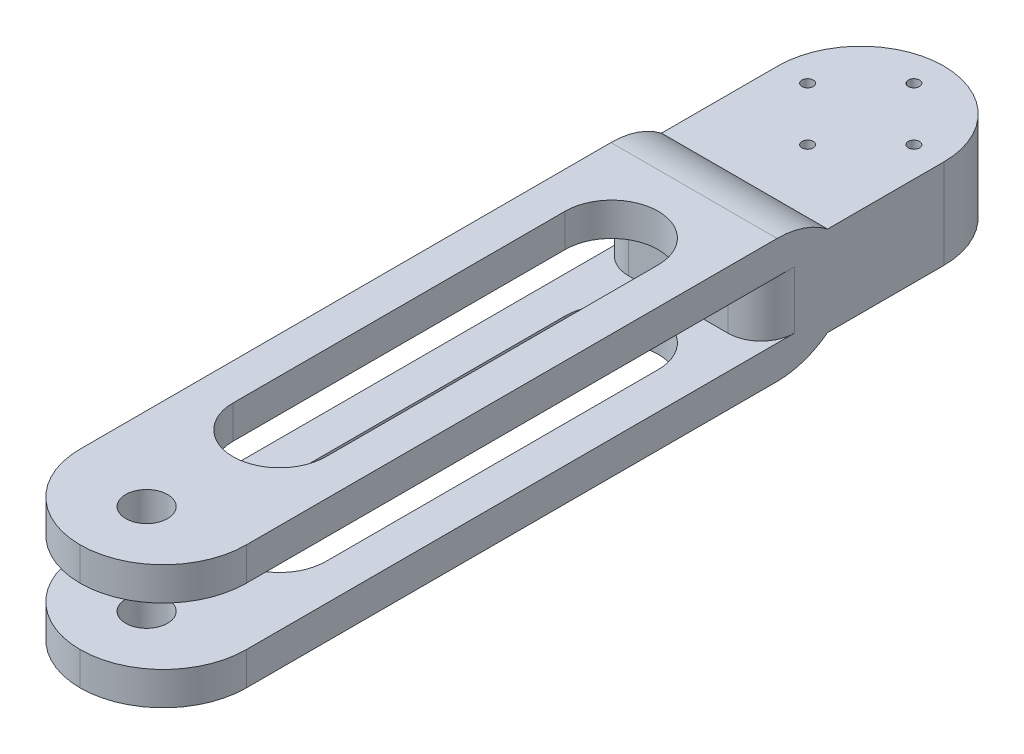
ISO-10303-21;
HEADER;
FILE_DESCRIPTION(('STEP AP214'),'2;1');
FILE_NAME('part.step','',(''),(''),'','','');
FILE_SCHEMA(('AUTOMOTIVE_DESIGN { 1 0 10303 214 1 1 1 1 }'));
ENDSEC;
DATA;
#1=APPLICATION_CONTEXT('core data for automotive mechanical design processes');
#2=APPLICATION_PROTOCOL_DEFINITION('international standard','automotive_design',2000,#1);
#3=PRODUCT_CONTEXT('',#1,'mechanical');
#4=PRODUCT('Part','Part','',(#3));
#5=PRODUCT_RELATED_PRODUCT_CATEGORY('part','',(#4));
#6=PRODUCT_DEFINITION_FORMATION('','',#4);
#7=PRODUCT_DEFINITION_CONTEXT('part definition',#1,'design');
#8=PRODUCT_DEFINITION('design','',#6,#7);
#9=PRODUCT_DEFINITION_SHAPE('','',#8);
#10=(LENGTH_UNIT() NAMED_UNIT(*) SI_UNIT(.MILLI.,.METRE.));
#11=(NAMED_UNIT(*) PLANE_ANGLE_UNIT() SI_UNIT($,.RADIAN.));
#12=(NAMED_UNIT(*) SI_UNIT($,.STERADIAN.) SOLID_ANGLE_UNIT());
#13=UNCERTAINTY_MEASURE_WITH_UNIT(LENGTH_MEASURE(1.E-05),#10,'distance_accuracy_value','');
#14=(GEOMETRIC_REPRESENTATION_CONTEXT(3) GLOBAL_UNCERTAINTY_ASSIGNED_CONTEXT((#13)) GLOBAL_UNIT_ASSIGNED_CONTEXT((#10,
#11,#12)) REPRESENTATION_CONTEXT('',''));
#15=CARTESIAN_POINT('',(0.,0.,0.));
#16=DIRECTION('',(0.,0.,1.));
#17=DIRECTION('',(1.,0.,0.));
#18=AXIS2_PLACEMENT_3D('',#15,#16,#17);
#19=CARTESIAN_POINT('',(12.5,4.325,10.));
#20=DIRECTION('',(0.,1.,0.));
#21=DIRECTION('',(0.,0.,1.));
#22=AXIS2_PLACEMENT_3D('',#19,#20,#21);
#23=PLANE('',#22);
#24=DIRECTION('',(0.,0.,-1.));
#25=VECTOR('',#24,1.);
#26=CARTESIAN_POINT('',(7.,4.325,10.));
#27=LINE('',#26,#25);
#28=CARTESIAN_POINT('',(7.,4.325,-20.));
#29=VERTEX_POINT('',#28);
#30=CARTESIAN_POINT('',(7.00000000000001,4.325,-70.));
#31=VERTEX_POINT('',#30);
#32=EDGE_CURVE('E294',#29,#31,#27,.T.);
#33=ORIENTED_EDGE('',*,*,#32,.T.);
#34=CARTESIAN_POINT('',(0.,4.325,-70.));
#35=DIRECTION('',(0.,1.,0.));
#36=DIRECTION('',(0.,0.,1.));
#37=AXIS2_PLACEMENT_3D('',#34,#35,#36);
#38=CIRCLE('',#37,7.00000000000001);
#39=CARTESIAN_POINT('',(-7.00000000000001,4.325,-70.));
#40=VERTEX_POINT('',#39);
#41=EDGE_CURVE('E300',#31,#40,#38,.T.);
#42=ORIENTED_EDGE('',*,*,#41,.T.);
#43=DIRECTION('',(0.,0.,1.));
#44=VECTOR('',#43,1.);
#45=CARTESIAN_POINT('',(-7.,4.325,10.));
#46=LINE('',#45,#44);
#47=CARTESIAN_POINT('',(-7.00000000000001,4.325,-20.));
#48=VERTEX_POINT('',#47);
#49=EDGE_CURVE('E278',#40,#48,#46,.T.);
#50=ORIENTED_EDGE('',*,*,#49,.T.);
#51=CARTESIAN_POINT('',(0.,4.325,-20.));
#52=DIRECTION('',(0.,1.,0.));
#53=DIRECTION('',(0.,0.,1.));
#54=AXIS2_PLACEMENT_3D('',#51,#52,#53);
#55=CIRCLE('',#54,7.);
#56=EDGE_CURVE('E286',#48,#29,#55,.T.);
#57=ORIENTED_EDGE('',*,*,#56,.T.);
#58=EDGE_LOOP('',(#33,#42,#50,#57));
#59=FACE_BOUND('',#58,.T.);
#60=CARTESIAN_POINT('',(0.,4.325,0.));
#61=DIRECTION('',(0.,1.,0.));
#62=DIRECTION('',(0.,0.,1.));
#63=AXIS2_PLACEMENT_3D('',#60,#61,#62);
#64=CIRCLE('',#63,3.15);
#65=CARTESIAN_POINT('',(0.,4.325,3.15));
#66=VERTEX_POINT('',#65);
#67=EDGE_CURVE('E316',#66,#66,#64,.T.);
#68=ORIENTED_EDGE('',*,*,#67,.T.);
#69=EDGE_LOOP('',(#68));
#70=FACE_BOUND('',#69,.T.);
#71=CARTESIAN_POINT('',(0.,4.325,-2.5));
#72=DIRECTION('',(0.,1.,0.));
#73=DIRECTION('',(0.,0.,1.));
#74=AXIS2_PLACEMENT_3D('',#71,#72,#73);
#75=CIRCLE('',#74,12.5);
#76=CARTESIAN_POINT('',(12.5,4.325,-2.5));
#77=VERTEX_POINT('',#76);
#78=CARTESIAN_POINT('',(0.,4.325,10.));
#79=VERTEX_POINT('',#78);
#80=EDGE_CURVE('E482',#77,#79,#75,.F.);
#81=ORIENTED_EDGE('',*,*,#80,.T.);
#82=CARTESIAN_POINT('',(0.,4.325,-2.5));
#83=DIRECTION('',(0.,1.,0.));
#84=DIRECTION('',(0.,0.,1.));
#85=AXIS2_PLACEMENT_3D('',#82,#83,#84);
#86=CIRCLE('',#85,12.5);
#87=CARTESIAN_POINT('',(-12.5,4.325,-2.5));
#88=VERTEX_POINT('',#87);
#89=EDGE_CURVE('E485',#79,#88,#86,.F.);
#90=ORIENTED_EDGE('',*,*,#89,.T.);
#91=DIRECTION('',(0.,0.,-1.));
#92=VECTOR('',#91,1.);
#93=CARTESIAN_POINT('',(-12.5,4.325,10.));
#94=LINE('',#93,#92);
#95=CARTESIAN_POINT('',(-12.5,4.325,-85.));
#96=VERTEX_POINT('',#95);
#97=EDGE_CURVE('E374',#88,#96,#94,.T.);
#98=ORIENTED_EDGE('',*,*,#97,.T.);
#99=CARTESIAN_POINT('',(-7.5,4.325,-85.));
#100=DIRECTION('',(0.,1.,0.));
#101=DIRECTION('',(0.,0.,1.));
#102=AXIS2_PLACEMENT_3D('',#99,#100,#101);
#103=CIRCLE('',#102,5.);
#104=CARTESIAN_POINT('',(-7.5,4.325,-80.));
#105=VERTEX_POINT('',#104);
#106=EDGE_CURVE('E516',#96,#105,#103,.T.);
#107=ORIENTED_EDGE('',*,*,#106,.T.);
#108=DIRECTION('',(-1.,0.,0.));
#109=VECTOR('',#108,1.);
#110=CARTESIAN_POINT('',(12.5,4.325,-80.));
#111=LINE('',#110,#109);
#112=CARTESIAN_POINT('',(7.5,4.325,-80.));
#113=VERTEX_POINT('',#112);
#114=EDGE_CURVE('E408',#113,#105,#111,.T.);
#115=ORIENTED_EDGE('',*,*,#114,.F.);
#116=CARTESIAN_POINT('',(7.5,4.325,-85.));
#117=DIRECTION('',(0.,1.,0.));
#118=DIRECTION('',(0.,0.,1.));
#119=AXIS2_PLACEMENT_3D('',#116,#117,#118);
#120=CIRCLE('',#119,5.);
#121=CARTESIAN_POINT('',(12.5,4.325,-85.));
#122=VERTEX_POINT('',#121);
#123=EDGE_CURVE('E11',#113,#122,#120,.T.);
#124=ORIENTED_EDGE('',*,*,#123,.T.);
#125=DIRECTION('',(0.,0.,-1.));
#126=VECTOR('',#125,1.);
#127=CARTESIAN_POINT('',(12.5,4.325,10.));
#128=LINE('',#127,#126);
#129=EDGE_CURVE('E68',#77,#122,#128,.T.);
#130=ORIENTED_EDGE('',*,*,#129,.F.);
#131=EDGE_LOOP('',(#81,#90,#98,#107,#115,#124,#130));
#132=FACE_BOUND('',#131,.T.);
#133=ADVANCED_FACE('F44',(#59,#70,#132),#23,.F.);
#134=CARTESIAN_POINT('',(12.5,4.325,-80.));
#135=DIRECTION('',(0.,0.,-1.));
#136=DIRECTION('',(-1.,0.,0.));
#137=AXIS2_PLACEMENT_3D('',#134,#135,#136);
#138=PLANE('',#137);
#139=ORIENTED_EDGE('',*,*,#114,.T.);
#140=DIRECTION('',(0.,-1.,0.));
#141=VECTOR('',#140,1.);
#142=CARTESIAN_POINT('',(-7.5,4.325,-80.));
#143=LINE('',#142,#141);
#144=CARTESIAN_POINT('',(-7.5,-4.325,-80.));
#145=VERTEX_POINT('',#144);
#146=EDGE_CURVE('E501',#105,#145,#143,.T.);
#147=ORIENTED_EDGE('',*,*,#146,.T.);
#148=DIRECTION('',(-1.,0.,0.));
#149=VECTOR('',#148,1.);
#150=CARTESIAN_POINT('',(12.5,-4.325,-80.));
#151=LINE('',#150,#149);
#152=CARTESIAN_POINT('',(7.5,-4.325,-80.));
#153=VERTEX_POINT('',#152);
#154=EDGE_CURVE('E404',#153,#145,#151,.T.);
#155=ORIENTED_EDGE('',*,*,#154,.F.);
#156=DIRECTION('',(0.,-1.,0.));
#157=VECTOR('',#156,1.);
#158=CARTESIAN_POINT('',(7.5,4.325,-80.));
#159=LINE('',#158,#157);
#160=EDGE_CURVE('E488',#153,#113,#159,.F.);
#161=ORIENTED_EDGE('',*,*,#160,.T.);
#162=EDGE_LOOP('',(#139,#147,#155,#161));
#163=FACE_BOUND('',#162,.T.);
#164=ADVANCED_FACE('F525',(#163),#138,.F.);
#165=CARTESIAN_POINT('',(12.5,-4.325,10.));
#166=DIRECTION('',(0.,-1.,0.));
#167=DIRECTION('',(0.,0.,-1.));
#168=AXIS2_PLACEMENT_3D('',#165,#166,#167);
#169=PLANE('',#168);
#170=DIRECTION('',(0.,0.,-1.));
#171=VECTOR('',#170,1.);
#172=CARTESIAN_POINT('',(-7.,-4.325,10.));
#173=LINE('',#172,#171);
#174=CARTESIAN_POINT('',(-7.,-4.325,-20.));
#175=VERTEX_POINT('',#174);
#176=CARTESIAN_POINT('',(-7.00000000000001,-4.325,-70.));
#177=VERTEX_POINT('',#176);
#178=EDGE_CURVE('E267',#175,#177,#173,.T.);
#179=ORIENTED_EDGE('',*,*,#178,.T.);
#180=CARTESIAN_POINT('',(0.,-4.325,-70.));
#181=DIRECTION('',(0.,-1.,0.));
#182=DIRECTION('',(0.,0.,-1.));
#183=AXIS2_PLACEMENT_3D('',#180,#181,#182);
#184=CIRCLE('',#183,7.00000000000001);
#185=CARTESIAN_POINT('',(7.00000000000001,-4.325,-70.));
#186=VERTEX_POINT('',#185);
#187=EDGE_CURVE('E220',#177,#186,#184,.T.);
#188=ORIENTED_EDGE('',*,*,#187,.T.);
#189=DIRECTION('',(0.,0.,1.));
#190=VECTOR('',#189,1.);
#191=CARTESIAN_POINT('',(7.,-4.325,10.));
#192=LINE('',#191,#190);
#193=CARTESIAN_POINT('',(7.,-4.325,-20.));
#194=VERTEX_POINT('',#193);
#195=EDGE_CURVE('E290',#186,#194,#192,.T.);
#196=ORIENTED_EDGE('',*,*,#195,.T.);
#197=CARTESIAN_POINT('',(0.,-4.325,-20.));
#198=DIRECTION('',(0.,-1.,0.));
#199=DIRECTION('',(0.,0.,-1.));
#200=AXIS2_PLACEMENT_3D('',#197,#198,#199);
#201=CIRCLE('',#200,7.);
#202=EDGE_CURVE('E282',#194,#175,#201,.T.);
#203=ORIENTED_EDGE('',*,*,#202,.T.);
#204=EDGE_LOOP('',(#179,#188,#196,#203));
#205=FACE_BOUND('',#204,.T.);
#206=CARTESIAN_POINT('',(0.,-4.325,0.));
#207=DIRECTION('',(0.,-1.,0.));
#208=DIRECTION('',(0.,0.,-1.));
#209=AXIS2_PLACEMENT_3D('',#206,#207,#208);
#210=CIRCLE('',#209,3.15);
#211=CARTESIAN_POINT('',(0.,-4.325,-3.15));
#212=VERTEX_POINT('',#211);
#213=EDGE_CURVE('E309',#212,#212,#210,.T.);
#214=ORIENTED_EDGE('',*,*,#213,.T.);
#215=EDGE_LOOP('',(#214));
#216=FACE_BOUND('',#215,.T.);
#217=DIRECTION('',(0.,0.,1.));
#218=VECTOR('',#217,1.);
#219=CARTESIAN_POINT('',(-12.5,-4.325,10.));
#220=LINE('',#219,#218);
#221=CARTESIAN_POINT('',(-12.5,-4.325,-85.));
#222=VERTEX_POINT('',#221);
#223=CARTESIAN_POINT('',(-12.5,-4.325,-2.5));
#224=VERTEX_POINT('',#223);
#225=EDGE_CURVE('E377',#222,#224,#220,.T.);
#226=ORIENTED_EDGE('',*,*,#225,.T.);
#227=CARTESIAN_POINT('',(0.,-4.325,-2.5));
#228=DIRECTION('',(0.,-1.,0.));
#229=DIRECTION('',(0.,0.,-1.));
#230=AXIS2_PLACEMENT_3D('',#227,#228,#229);
#231=CIRCLE('',#230,12.5);
#232=CARTESIAN_POINT('',(0.,-4.325,10.));
#233=VERTEX_POINT('',#232);
#234=EDGE_CURVE('E479',#224,#233,#231,.F.);
#235=ORIENTED_EDGE('',*,*,#234,.T.);
#236=CARTESIAN_POINT('',(0.,-4.325,-2.5));
#237=DIRECTION('',(0.,-1.,0.));
#238=DIRECTION('',(0.,0.,-1.));
#239=AXIS2_PLACEMENT_3D('',#236,#237,#238);
#240=CIRCLE('',#239,12.5);
#241=CARTESIAN_POINT('',(12.5,-4.325,-2.5));
#242=VERTEX_POINT('',#241);
#243=EDGE_CURVE('E476',#233,#242,#240,.F.);
#244=ORIENTED_EDGE('',*,*,#243,.T.);
#245=DIRECTION('',(0.,0.,1.));
#246=VECTOR('',#245,1.);
#247=CARTESIAN_POINT('',(12.5,-4.325,10.));
#248=LINE('',#247,#246);
#249=CARTESIAN_POINT('',(12.5,-4.325,-85.));
#250=VERTEX_POINT('',#249);
#251=EDGE_CURVE('E60',#250,#242,#248,.T.);
#252=ORIENTED_EDGE('',*,*,#251,.F.);
#253=CARTESIAN_POINT('',(7.5,-4.325,-85.));
#254=DIRECTION('',(0.,-1.,0.));
#255=DIRECTION('',(0.,0.,-1.));
#256=AXIS2_PLACEMENT_3D('',#253,#254,#255);
#257=CIRCLE('',#256,5.);
#258=EDGE_CURVE('E53',#250,#153,#257,.T.);
#259=ORIENTED_EDGE('',*,*,#258,.T.);
#260=ORIENTED_EDGE('',*,*,#154,.T.);
#261=CARTESIAN_POINT('',(-7.5,-4.325,-85.));
#262=DIRECTION('',(0.,-1.,0.));
#263=DIRECTION('',(0.,0.,-1.));
#264=AXIS2_PLACEMENT_3D('',#261,#262,#263);
#265=CIRCLE('',#264,5.);
#266=EDGE_CURVE('E512',#145,#222,#265,.T.);
#267=ORIENTED_EDGE('',*,*,#266,.T.);
#268=EDGE_LOOP('',(#226,#235,#244,#252,#259,#260,#267));
#269=FACE_BOUND('',#268,.T.);
#270=ADVANCED_FACE('F520',(#205,#216,#269),#169,.F.);
#271=CARTESIAN_POINT('',(12.5,-9.32500000000001,-90.));
#272=DIRECTION('',(0.,1.,0.));
#273=DIRECTION('',(0.,0.,1.));
#274=AXIS2_PLACEMENT_3D('',#271,#272,#273);
#275=PLANE('',#274);
#276=DIRECTION('',(0.,0.,-1.));
#277=VECTOR('',#276,1.);
#278=CARTESIAN_POINT('',(7.00000000000001,-9.32500000000004,-70.));
#279=LINE('',#278,#277);
#280=CARTESIAN_POINT('',(7.,-9.32500000000005,-20.));
#281=VERTEX_POINT('',#280);
#282=CARTESIAN_POINT('',(7.00000000000001,-9.32500000000004,-70.));
#283=VERTEX_POINT('',#282);
#284=EDGE_CURVE('E241',#281,#283,#279,.T.);
#285=ORIENTED_EDGE('',*,*,#284,.T.);
#286=CARTESIAN_POINT('',(0.,-9.32500000000004,-70.));
#287=DIRECTION('',(0.,1.,0.));
#288=DIRECTION('',(0.,0.,-1.));
#289=AXIS2_PLACEMENT_3D('',#286,#287,#288);
#290=CIRCLE('',#289,7.00000000000001);
#291=CARTESIAN_POINT('',(-7.00000000000001,-9.32500000000004,-70.));
#292=VERTEX_POINT('',#291);
#293=EDGE_CURVE('E217',#283,#292,#290,.T.);
#294=ORIENTED_EDGE('',*,*,#293,.T.);
#295=DIRECTION('',(0.,0.,1.));
#296=VECTOR('',#295,1.);
#297=CARTESIAN_POINT('',(-7.00000000000001,-9.32500000000004,-70.));
#298=LINE('',#297,#296);
#299=CARTESIAN_POINT('',(-7.,-9.325,-20.));
#300=VERTEX_POINT('',#299);
#301=EDGE_CURVE('E229',#292,#300,#298,.T.);
#302=ORIENTED_EDGE('',*,*,#301,.T.);
#303=CARTESIAN_POINT('',(0.,-9.32500000000005,-20.));
#304=DIRECTION('',(0.,1.,0.));
#305=DIRECTION('',(0.,0.,1.));
#306=AXIS2_PLACEMENT_3D('',#303,#304,#305);
#307=CIRCLE('',#306,7.);
#308=EDGE_CURVE('E236',#300,#281,#307,.T.);
#309=ORIENTED_EDGE('',*,*,#308,.T.);
#310=EDGE_LOOP('',(#285,#294,#302,#309));
#311=FACE_BOUND('',#310,.T.);
#312=CARTESIAN_POINT('',(0.,-9.32500000000004,0.));
#313=DIRECTION('',(0.,1.,0.));
#314=DIRECTION('',(0.,0.,1.));
#315=AXIS2_PLACEMENT_3D('',#312,#313,#314);
#316=CIRCLE('',#315,3.15);
#317=CARTESIAN_POINT('',(0.,-9.32500000000004,3.15));
#318=VERTEX_POINT('',#317);
#319=EDGE_CURVE('E305',#318,#318,#316,.T.);
#320=ORIENTED_EDGE('',*,*,#319,.T.);
#321=EDGE_LOOP('',(#320));
#322=FACE_BOUND('',#321,.T.);
#323=DIRECTION('',(0.,0.,-1.));
#324=VECTOR('',#323,1.);
#325=CARTESIAN_POINT('',(-12.5,-9.32500000000001,-90.));
#326=LINE('',#325,#324);
#327=CARTESIAN_POINT('',(-12.5,-9.325,-2.50000000000003));
#328=VERTEX_POINT('',#327);
#329=CARTESIAN_POINT('',(-12.5,-9.32500000000001,-82.4010280300556));
#330=VERTEX_POINT('',#329);
#331=EDGE_CURVE('E382',#328,#330,#326,.T.);
#332=ORIENTED_EDGE('',*,*,#331,.T.);
#333=DIRECTION('',(-1.,0.,0.));
#334=VECTOR('',#333,1.);
#335=CARTESIAN_POINT('',(12.5,-9.32500000000001,-82.4010280300556));
#336=LINE('',#335,#334);
#337=CARTESIAN_POINT('',(12.5,-9.32500000000001,-82.4010280300556));
#338=VERTEX_POINT('',#337);
#339=EDGE_CURVE('E463',#330,#338,#336,.F.);
#340=ORIENTED_EDGE('',*,*,#339,.T.);
#341=DIRECTION('',(0.,0.,-1.));
#342=VECTOR('',#341,1.);
#343=CARTESIAN_POINT('',(12.5,-9.32500000000001,-90.));
#344=LINE('',#343,#342);
#345=CARTESIAN_POINT('',(12.5,-9.325,-2.50000000000003));
#346=VERTEX_POINT('',#345);
#347=EDGE_CURVE('E358',#346,#338,#344,.T.);
#348=ORIENTED_EDGE('',*,*,#347,.F.);
#349=CARTESIAN_POINT('',(0.,-9.325,-2.5));
#350=DIRECTION('',(0.,1.,0.));
#351=DIRECTION('',(0.,0.,1.));
#352=AXIS2_PLACEMENT_3D('',#349,#350,#351);
#353=CIRCLE('',#352,12.5);
#354=CARTESIAN_POINT('',(0.,-9.325,10.));
#355=VERTEX_POINT('',#354);
#356=EDGE_CURVE('E457',#346,#355,#353,.F.);
#357=ORIENTED_EDGE('',*,*,#356,.T.);
#358=CARTESIAN_POINT('',(0.,-9.325,-2.5));
#359=DIRECTION('',(0.,1.,0.));
#360=DIRECTION('',(0.,0.,1.));
#361=AXIS2_PLACEMENT_3D('',#358,#359,#360);
#362=CIRCLE('',#361,12.5);
#363=EDGE_CURVE('E460',#355,#328,#362,.F.);
#364=ORIENTED_EDGE('',*,*,#363,.T.);
#365=EDGE_LOOP('',(#332,#340,#348,#357,#364));
#366=FACE_BOUND('',#365,.T.);
#367=ADVANCED_FACE('F238',(#311,#322,#366),#275,.F.);
#368=CARTESIAN_POINT('',(12.5,-6.75,-90.));
#369=DIRECTION('',(0.,1.,0.));
#370=DIRECTION('',(0.,0.,1.));
#371=AXIS2_PLACEMENT_3D('',#368,#369,#370);
#372=PLANE('',#371);
#373=CARTESIAN_POINT('',(0.,-6.75,-115.5));
#374=DIRECTION('',(0.,1.,0.));
#375=DIRECTION('',(0.,0.,1.));
#376=AXIS2_PLACEMENT_3D('',#373,#374,#375);
#377=CIRCLE('',#376,0.849999999999999);
#378=CARTESIAN_POINT('',(0.,-6.75,-114.65));
#379=VERTEX_POINT('',#378);
#380=EDGE_CURVE('E348',#379,#379,#377,.T.);
#381=ORIENTED_EDGE('',*,*,#380,.T.);
#382=EDGE_LOOP('',(#381));
#383=FACE_BOUND('',#382,.T.);
#384=CARTESIAN_POINT('',(8.00000000000001,-6.75,-107.5));
#385=DIRECTION('',(0.,1.,0.));
#386=DIRECTION('',(0.,0.,1.));
#387=AXIS2_PLACEMENT_3D('',#384,#385,#386);
#388=CIRCLE('',#387,0.849999999999994);
#389=CARTESIAN_POINT('',(8.00000000000001,-6.75,-106.65));
#390=VERTEX_POINT('',#389);
#391=EDGE_CURVE('E344',#390,#390,#388,.T.);
#392=ORIENTED_EDGE('',*,*,#391,.T.);
#393=EDGE_LOOP('',(#392));
#394=FACE_BOUND('',#393,.T.);
#395=CARTESIAN_POINT('',(-8.00000000000001,-6.75,-107.5));
#396=DIRECTION('',(0.,1.,0.));
#397=DIRECTION('',(0.,0.,1.));
#398=AXIS2_PLACEMENT_3D('',#395,#396,#397);
#399=CIRCLE('',#398,0.849999999999998);
#400=CARTESIAN_POINT('',(-8.00000000000001,-6.75,-106.65));
#401=VERTEX_POINT('',#400);
#402=EDGE_CURVE('E340',#401,#401,#399,.T.);
#403=ORIENTED_EDGE('',*,*,#402,.T.);
#404=EDGE_LOOP('',(#403));
#405=FACE_BOUND('',#404,.T.);
#406=CARTESIAN_POINT('',(0.,-6.75,-99.5));
#407=DIRECTION('',(0.,1.,0.));
#408=DIRECTION('',(0.,0.,1.));
#409=AXIS2_PLACEMENT_3D('',#406,#407,#408);
#410=CIRCLE('',#409,0.849999999999998);
#411=CARTESIAN_POINT('',(0.,-6.75,-98.65));
#412=VERTEX_POINT('',#411);
#413=EDGE_CURVE('E325',#412,#412,#410,.T.);
#414=ORIENTED_EDGE('',*,*,#413,.T.);
#415=EDGE_LOOP('',(#414));
#416=FACE_BOUND('',#415,.T.);
#417=DIRECTION('',(0.,0.,-1.));
#418=VECTOR('',#417,1.);
#419=CARTESIAN_POINT('',(-12.5,-6.75,-90.));
#420=LINE('',#419,#418);
#421=CARTESIAN_POINT('',(-12.5,-6.75,-90.));
#422=VERTEX_POINT('',#421);
#423=CARTESIAN_POINT('',(-12.5,-6.75,-107.5));
#424=VERTEX_POINT('',#423);
#425=EDGE_CURVE('E386',#422,#424,#420,.T.);
#426=ORIENTED_EDGE('',*,*,#425,.T.);
#427=CARTESIAN_POINT('',(0.,-6.75,-107.5));
#428=DIRECTION('',(0.,1.,0.));
#429=DIRECTION('',(0.,0.,1.));
#430=AXIS2_PLACEMENT_3D('',#427,#428,#429);
#431=CIRCLE('',#430,12.5);
#432=CARTESIAN_POINT('',(0.,-6.75,-120.));
#433=VERTEX_POINT('',#432);
#434=EDGE_CURVE('E439',#424,#433,#431,.F.);
#435=ORIENTED_EDGE('',*,*,#434,.T.);
#436=CARTESIAN_POINT('',(0.,-6.75,-107.5));
#437=DIRECTION('',(0.,1.,0.));
#438=DIRECTION('',(0.,0.,1.));
#439=AXIS2_PLACEMENT_3D('',#436,#437,#438);
#440=CIRCLE('',#439,12.5);
#441=CARTESIAN_POINT('',(12.5,-6.75,-107.5));
#442=VERTEX_POINT('',#441);
#443=EDGE_CURVE('E436',#433,#442,#440,.F.);
#444=ORIENTED_EDGE('',*,*,#443,.T.);
#445=DIRECTION('',(0.,0.,-1.));
#446=VECTOR('',#445,1.);
#447=CARTESIAN_POINT('',(12.5,-6.75,-90.));
#448=LINE('',#447,#446);
#449=CARTESIAN_POINT('',(12.5,-6.75,-90.));
#450=VERTEX_POINT('',#449);
#451=EDGE_CURVE('E362',#450,#442,#448,.T.);
#452=ORIENTED_EDGE('',*,*,#451,.F.);
#453=DIRECTION('',(-1.,0.,0.));
#454=VECTOR('',#453,1.);
#455=CARTESIAN_POINT('',(12.5,-6.75,-90.));
#456=LINE('',#455,#454);
#457=EDGE_CURVE('E400',#450,#422,#456,.T.);
#458=ORIENTED_EDGE('',*,*,#457,.T.);
#459=EDGE_LOOP('',(#426,#435,#444,#452,#458));
#460=FACE_BOUND('',#459,.T.);
#461=ADVANCED_FACE('F560',(#383,#394,#405,#416,#460),#372,.F.);
#462=CARTESIAN_POINT('',(12.5,6.75,-90.));
#463=DIRECTION('',(0.,-1.,0.));
#464=DIRECTION('',(0.,0.,-1.));
#465=AXIS2_PLACEMENT_3D('',#462,#463,#464);
#466=PLANE('',#465);
#467=CARTESIAN_POINT('',(0.,6.75000000000002,-115.5));
#468=DIRECTION('',(0.,1.,0.));
#469=DIRECTION('',(0.,0.,1.));
#470=AXIS2_PLACEMENT_3D('',#467,#468,#469);
#471=CIRCLE('',#470,0.849999999999999);
#472=CARTESIAN_POINT('',(0.,6.75000000000002,-114.65));
#473=VERTEX_POINT('',#472);
#474=EDGE_CURVE('E321',#473,#473,#471,.T.);
#475=ORIENTED_EDGE('',*,*,#474,.F.);
#476=EDGE_LOOP('',(#475));
#477=FACE_BOUND('',#476,.T.);
#478=CARTESIAN_POINT('',(8.00000000000001,6.75000000000001,-107.5));
#479=DIRECTION('',(0.,1.,0.));
#480=DIRECTION('',(0.,0.,1.));
#481=AXIS2_PLACEMENT_3D('',#478,#479,#480);
#482=CIRCLE('',#481,0.849999999999994);
#483=CARTESIAN_POINT('',(8.00000000000001,6.75000000000001,-106.65));
#484=VERTEX_POINT('',#483);
#485=EDGE_CURVE('E326',#484,#484,#482,.T.);
#486=ORIENTED_EDGE('',*,*,#485,.F.);
#487=EDGE_LOOP('',(#486));
#488=FACE_BOUND('',#487,.T.);
#489=CARTESIAN_POINT('',(-8.00000000000001,6.75000000000001,-107.5));
#490=DIRECTION('',(0.,1.,0.));
#491=DIRECTION('',(0.,0.,-1.));
#492=AXIS2_PLACEMENT_3D('',#489,#490,#491);
#493=CIRCLE('',#492,0.849999999999998);
#494=CARTESIAN_POINT('',(-8.00000000000001,6.75000000000001,-108.35));
#495=VERTEX_POINT('',#494);
#496=EDGE_CURVE('E330',#495,#495,#493,.T.);
#497=ORIENTED_EDGE('',*,*,#496,.F.);
#498=EDGE_LOOP('',(#497));
#499=FACE_BOUND('',#498,.T.);
#500=CARTESIAN_POINT('',(0.,6.75000000000001,-99.5));
#501=DIRECTION('',(0.,1.,0.));
#502=DIRECTION('',(0.,0.,-1.));
#503=AXIS2_PLACEMENT_3D('',#500,#501,#502);
#504=CIRCLE('',#503,0.849999999999998);
#505=CARTESIAN_POINT('',(0.,6.75000000000001,-100.35));
#506=VERTEX_POINT('',#505);
#507=EDGE_CURVE('E320',#506,#506,#504,.T.);
#508=ORIENTED_EDGE('',*,*,#507,.F.);
#509=EDGE_LOOP('',(#508));
#510=FACE_BOUND('',#509,.T.);
#511=CARTESIAN_POINT('',(0.,6.75,-107.5));
#512=DIRECTION('',(0.,-1.,0.));
#513=DIRECTION('',(0.,0.,-1.));
#514=AXIS2_PLACEMENT_3D('',#511,#512,#513);
#515=CIRCLE('',#514,12.5);
#516=CARTESIAN_POINT('',(12.5,6.75,-107.5));
#517=VERTEX_POINT('',#516);
#518=CARTESIAN_POINT('',(0.,6.75,-120.));
#519=VERTEX_POINT('',#518);
#520=EDGE_CURVE('E412',#517,#519,#515,.F.);
#521=ORIENTED_EDGE('',*,*,#520,.T.);
#522=CARTESIAN_POINT('',(0.,6.75,-107.5));
#523=DIRECTION('',(0.,-1.,0.));
#524=DIRECTION('',(0.,0.,-1.));
#525=AXIS2_PLACEMENT_3D('',#522,#523,#524);
#526=CIRCLE('',#525,12.5);
#527=CARTESIAN_POINT('',(-12.5,6.75,-107.5));
#528=VERTEX_POINT('',#527);
#529=EDGE_CURVE('E415',#519,#528,#526,.F.);
#530=ORIENTED_EDGE('',*,*,#529,.T.);
#531=DIRECTION('',(0.,0.,1.));
#532=VECTOR('',#531,1.);
#533=CARTESIAN_POINT('',(-12.5,6.75,-90.));
#534=LINE('',#533,#532);
#535=CARTESIAN_POINT('',(-12.5,6.75,-90.));
#536=VERTEX_POINT('',#535);
#537=EDGE_CURVE('E390',#528,#536,#534,.T.);
#538=ORIENTED_EDGE('',*,*,#537,.T.);
#539=DIRECTION('',(-1.,0.,0.));
#540=VECTOR('',#539,1.);
#541=CARTESIAN_POINT('',(12.5,6.75,-90.));
#542=LINE('',#541,#540);
#543=CARTESIAN_POINT('',(12.5,6.75,-90.));
#544=VERTEX_POINT('',#543);
#545=EDGE_CURVE('E373',#544,#536,#542,.T.);
#546=ORIENTED_EDGE('',*,*,#545,.F.);
#547=DIRECTION('',(0.,0.,1.));
#548=VECTOR('',#547,1.);
#549=CARTESIAN_POINT('',(12.5,6.75,-90.));
#550=LINE('',#549,#548);
#551=EDGE_CURVE('E366',#517,#544,#550,.T.);
#552=ORIENTED_EDGE('',*,*,#551,.F.);
#553=EDGE_LOOP('',(#521,#530,#538,#546,#552));
#554=FACE_BOUND('',#553,.T.);
#555=ADVANCED_FACE('F573',(#477,#488,#499,#510,#554),#466,.F.);
#556=CARTESIAN_POINT('',(12.5,9.32500000000001,-90.));
#557=DIRECTION('',(0.,-1.,0.));
#558=DIRECTION('',(0.,0.,-1.));
#559=AXIS2_PLACEMENT_3D('',#556,#557,#558);
#560=PLANE('',#559);
#561=DIRECTION('',(0.,0.,1.));
#562=VECTOR('',#561,1.);
#563=CARTESIAN_POINT('',(-7.00000000000001,9.32500000000001,-70.));
#564=LINE('',#563,#562);
#565=CARTESIAN_POINT('',(-7.00000000000001,9.32500000000001,-70.));
#566=VERTEX_POINT('',#565);
#567=CARTESIAN_POINT('',(-7.,9.325,-20.));
#568=VERTEX_POINT('',#567);
#569=EDGE_CURVE('E257',#566,#568,#564,.T.);
#570=ORIENTED_EDGE('',*,*,#569,.F.);
#571=CARTESIAN_POINT('',(0.,9.32500000000001,-70.));
#572=DIRECTION('',(0.,1.,0.));
#573=DIRECTION('',(0.,0.,-1.));
#574=AXIS2_PLACEMENT_3D('',#571,#572,#573);
#575=CIRCLE('',#574,7.00000000000001);
#576=CARTESIAN_POINT('',(7.00000000000001,9.32500000000001,-70.));
#577=VERTEX_POINT('',#576);
#578=EDGE_CURVE('E254',#577,#566,#575,.T.);
#579=ORIENTED_EDGE('',*,*,#578,.F.);
#580=DIRECTION('',(0.,0.,-1.));
#581=VECTOR('',#580,1.);
#582=CARTESIAN_POINT('',(7.00000000000001,9.32500000000001,-70.));
#583=LINE('',#582,#581);
#584=CARTESIAN_POINT('',(7.,9.325,-20.));
#585=VERTEX_POINT('',#584);
#586=EDGE_CURVE('E243',#585,#577,#583,.T.);
#587=ORIENTED_EDGE('',*,*,#586,.F.);
#588=CARTESIAN_POINT('',(0.,9.325,-20.));
#589=DIRECTION('',(0.,1.,0.));
#590=DIRECTION('',(0.,0.,1.));
#591=AXIS2_PLACEMENT_3D('',#588,#589,#590);
#592=CIRCLE('',#591,7.);
#593=EDGE_CURVE('E247',#568,#585,#592,.T.);
#594=ORIENTED_EDGE('',*,*,#593,.F.);
#595=EDGE_LOOP('',(#570,#579,#587,#594));
#596=FACE_BOUND('',#595,.T.);
#597=CARTESIAN_POINT('',(0.,9.325,0.));
#598=DIRECTION('',(0.,1.,0.));
#599=DIRECTION('',(0.,0.,1.));
#600=AXIS2_PLACEMENT_3D('',#597,#598,#599);
#601=CIRCLE('',#600,3.15);
#602=CARTESIAN_POINT('',(0.,9.325,3.15));
#603=VERTEX_POINT('',#602);
#604=EDGE_CURVE('E304',#603,#603,#601,.T.);
#605=ORIENTED_EDGE('',*,*,#604,.F.);
#606=EDGE_LOOP('',(#605));
#607=FACE_BOUND('',#606,.T.);
#608=DIRECTION('',(0.,0.,1.));
#609=VECTOR('',#608,1.);
#610=CARTESIAN_POINT('',(12.5,9.32500000000001,-90.));
#611=LINE('',#610,#609);
#612=CARTESIAN_POINT('',(12.5,9.32500000000001,-82.4010280300556));
#613=VERTEX_POINT('',#612);
#614=CARTESIAN_POINT('',(12.5,9.325,-2.50000000000003));
#615=VERTEX_POINT('',#614);
#616=EDGE_CURVE('E369',#613,#615,#611,.T.);
#617=ORIENTED_EDGE('',*,*,#616,.F.);
#618=DIRECTION('',(1.,0.,0.));
#619=VECTOR('',#618,1.);
#620=CARTESIAN_POINT('',(12.5,9.32500000000001,-82.4010280300556));
#621=LINE('',#620,#619);
#622=CARTESIAN_POINT('',(-12.5,9.32500000000001,-82.4010280300556));
#623=VERTEX_POINT('',#622);
#624=EDGE_CURVE('E472',#613,#623,#621,.F.);
#625=ORIENTED_EDGE('',*,*,#624,.T.);
#626=DIRECTION('',(0.,0.,1.));
#627=VECTOR('',#626,1.);
#628=CARTESIAN_POINT('',(-12.5,9.32500000000001,-90.));
#629=LINE('',#628,#627);
#630=CARTESIAN_POINT('',(-12.5,9.325,-2.50000000000003));
#631=VERTEX_POINT('',#630);
#632=EDGE_CURVE('E355',#623,#631,#629,.T.);
#633=ORIENTED_EDGE('',*,*,#632,.T.);
#634=CARTESIAN_POINT('',(0.,9.325,-2.5));
#635=DIRECTION('',(0.,-1.,0.));
#636=DIRECTION('',(0.,0.,-1.));
#637=AXIS2_PLACEMENT_3D('',#634,#635,#636);
#638=CIRCLE('',#637,12.5);
#639=CARTESIAN_POINT('',(0.,9.325,10.));
#640=VERTEX_POINT('',#639);
#641=EDGE_CURVE('E469',#631,#640,#638,.F.);
#642=ORIENTED_EDGE('',*,*,#641,.T.);
#643=CARTESIAN_POINT('',(0.,9.325,-2.5));
#644=DIRECTION('',(0.,-1.,0.));
#645=DIRECTION('',(0.,0.,-1.));
#646=AXIS2_PLACEMENT_3D('',#643,#644,#645);
#647=CIRCLE('',#646,12.5);
#648=EDGE_CURVE('E466',#640,#615,#647,.F.);
#649=ORIENTED_EDGE('',*,*,#648,.T.);
#650=EDGE_LOOP('',(#617,#625,#633,#642,#649));
#651=FACE_BOUND('',#650,.T.);
#652=ADVANCED_FACE('F583',(#596,#607,#651),#560,.F.);
#653=CARTESIAN_POINT('',(12.5,0.,0.));
#654=DIRECTION('',(1.,0.,0.));
#655=DIRECTION('',(0.,0.,-1.));
#656=AXIS2_PLACEMENT_3D('',#653,#654,#655);
#657=PLANE('',#656);
#658=DIRECTION('',(0.,-1.,0.));
#659=VECTOR('',#658,1.);
#660=CARTESIAN_POINT('',(12.5,-4.325,-85.));
#661=LINE('',#660,#659);
#662=EDGE_CURVE('E509',#122,#250,#661,.T.);
#663=ORIENTED_EDGE('',*,*,#662,.T.);
#664=ORIENTED_EDGE('',*,*,#251,.T.);
#665=DIRECTION('',(0.,-1.,0.));
#666=VECTOR('',#665,1.);
#667=CARTESIAN_POINT('',(12.5,-9.325,-2.5));
#668=LINE('',#667,#666);
#669=EDGE_CURVE('E445',#242,#346,#668,.T.);
#670=ORIENTED_EDGE('',*,*,#669,.T.);
#671=ORIENTED_EDGE('',*,*,#347,.T.);
#672=CARTESIAN_POINT('',(12.5,3.17499999999998,-82.4010280300556));
#673=DIRECTION('',(1.,0.,0.));
#674=DIRECTION('',(0.,0.,-1.));
#675=AXIS2_PLACEMENT_3D('',#672,#673,#674);
#676=CIRCLE('',#675,12.5);
#677=EDGE_CURVE('E451',#338,#450,#676,.T.);
#678=ORIENTED_EDGE('',*,*,#677,.T.);
#679=ORIENTED_EDGE('',*,*,#451,.T.);
#680=DIRECTION('',(0.,1.,0.));
#681=VECTOR('',#680,1.);
#682=CARTESIAN_POINT('',(12.5,6.75,-107.5));
#683=LINE('',#682,#681);
#684=EDGE_CURVE('E454',#442,#517,#683,.T.);
#685=ORIENTED_EDGE('',*,*,#684,.T.);
#686=ORIENTED_EDGE('',*,*,#551,.T.);
#687=CARTESIAN_POINT('',(12.5,-3.17499999999998,-82.4010280300556));
#688=DIRECTION('',(1.,0.,0.));
#689=DIRECTION('',(0.,0.,-1.));
#690=AXIS2_PLACEMENT_3D('',#687,#688,#689);
#691=CIRCLE('',#690,12.5);
#692=EDGE_CURVE('E448',#544,#613,#691,.T.);
#693=ORIENTED_EDGE('',*,*,#692,.T.);
#694=ORIENTED_EDGE('',*,*,#616,.T.);
#695=DIRECTION('',(0.,-1.,0.));
#696=VECTOR('',#695,1.);
#697=CARTESIAN_POINT('',(12.5,4.325,-2.5));
#698=LINE('',#697,#696);
#699=EDGE_CURVE('E442',#615,#77,#698,.T.);
#700=ORIENTED_EDGE('',*,*,#699,.T.);
#701=ORIENTED_EDGE('',*,*,#129,.T.);
#702=EDGE_LOOP('',(#663,#664,#670,#671,#678,#679,#685,#686,#693,#694,#700,#701));
#703=FACE_BOUND('',#702,.T.);
#704=ADVANCED_FACE('F549',(#703),#657,.T.);
#705=CARTESIAN_POINT('',(-12.5,0.,0.));
#706=DIRECTION('',(1.,0.,0.));
#707=DIRECTION('',(0.,0.,-1.));
#708=AXIS2_PLACEMENT_3D('',#705,#706,#707);
#709=PLANE('',#708);
#710=ORIENTED_EDGE('',*,*,#225,.F.);
#711=DIRECTION('',(0.,-1.,0.));
#712=VECTOR('',#711,1.);
#713=CARTESIAN_POINT('',(-12.5,0.,-85.));
#714=LINE('',#713,#712);
#715=EDGE_CURVE('E505',#222,#96,#714,.F.);
#716=ORIENTED_EDGE('',*,*,#715,.T.);
#717=ORIENTED_EDGE('',*,*,#97,.F.);
#718=DIRECTION('',(0.,-1.,0.));
#719=VECTOR('',#718,1.);
#720=CARTESIAN_POINT('',(-12.5,0.,-2.50000000000001));
#721=LINE('',#720,#719);
#722=EDGE_CURVE('E418',#88,#631,#721,.F.);
#723=ORIENTED_EDGE('',*,*,#722,.T.);
#724=ORIENTED_EDGE('',*,*,#632,.F.);
#725=CARTESIAN_POINT('',(-12.5,-3.17499999999998,-82.4010280300556));
#726=DIRECTION('',(1.,0.,0.));
#727=DIRECTION('',(0.,0.,-1.));
#728=AXIS2_PLACEMENT_3D('',#725,#726,#727);
#729=CIRCLE('',#728,12.5);
#730=EDGE_CURVE('E426',#623,#536,#729,.F.);
#731=ORIENTED_EDGE('',*,*,#730,.T.);
#732=ORIENTED_EDGE('',*,*,#537,.F.);
#733=DIRECTION('',(0.,1.,0.));
#734=VECTOR('',#733,1.);
#735=CARTESIAN_POINT('',(-12.5,0.,-107.5));
#736=LINE('',#735,#734);
#737=EDGE_CURVE('E432',#528,#424,#736,.F.);
#738=ORIENTED_EDGE('',*,*,#737,.T.);
#739=ORIENTED_EDGE('',*,*,#425,.F.);
#740=CARTESIAN_POINT('',(-12.5,3.17499999999998,-82.4010280300556));
#741=DIRECTION('',(1.,0.,0.));
#742=DIRECTION('',(0.,0.,-1.));
#743=AXIS2_PLACEMENT_3D('',#740,#741,#742);
#744=CIRCLE('',#743,12.5);
#745=EDGE_CURVE('E429',#422,#330,#744,.F.);
#746=ORIENTED_EDGE('',*,*,#745,.T.);
#747=ORIENTED_EDGE('',*,*,#331,.F.);
#748=DIRECTION('',(0.,-1.,0.));
#749=VECTOR('',#748,1.);
#750=CARTESIAN_POINT('',(-12.5,0.,-2.50000000000001));
#751=LINE('',#750,#749);
#752=EDGE_CURVE('E422',#328,#224,#751,.F.);
#753=ORIENTED_EDGE('',*,*,#752,.T.);
#754=EDGE_LOOP('',(#710,#716,#717,#723,#724,#731,#732,#738,#739,#746,#747,#753));
#755=FACE_BOUND('',#754,.T.);
#756=ADVANCED_FACE('F537',(#755),#709,.F.);
#757=CARTESIAN_POINT('',(0.,0.,-107.5));
#758=DIRECTION('',(0.,-1.,0.));
#759=DIRECTION('',(0.,0.,-1.));
#760=AXIS2_PLACEMENT_3D('',#757,#758,#759);
#761=CYLINDRICAL_SURFACE('',#760,12.5);
#762=ORIENTED_EDGE('',*,*,#684,.F.);
#763=ORIENTED_EDGE('',*,*,#443,.F.);
#764=DIRECTION('',(0.,1.,0.));
#765=VECTOR('',#764,1.);
#766=CARTESIAN_POINT('',(0.,-6.75,-120.));
#767=LINE('',#766,#765);
#768=EDGE_CURVE('E378',#519,#433,#767,.F.);
#769=ORIENTED_EDGE('',*,*,#768,.F.);
#770=ORIENTED_EDGE('',*,*,#520,.F.);
#771=EDGE_LOOP('',(#762,#763,#769,#770));
#772=FACE_BOUND('',#771,.T.);
#773=ADVANCED_FACE('F565',(#772),#761,.T.);
#774=CARTESIAN_POINT('',(0.,6.75,-107.5));
#775=DIRECTION('',(0.,1.,0.));
#776=DIRECTION('',(0.,0.,1.));
#777=AXIS2_PLACEMENT_3D('',#774,#775,#776);
#778=CYLINDRICAL_SURFACE('',#777,12.5);
#779=ORIENTED_EDGE('',*,*,#434,.F.);
#780=ORIENTED_EDGE('',*,*,#737,.F.);
#781=ORIENTED_EDGE('',*,*,#529,.F.);
#782=ORIENTED_EDGE('',*,*,#768,.T.);
#783=EDGE_LOOP('',(#779,#780,#781,#782));
#784=FACE_BOUND('',#783,.T.);
#785=ADVANCED_FACE('F569',(#784),#778,.T.);
#786=CARTESIAN_POINT('',(12.5,3.17499999999998,-82.4010280300556));
#787=DIRECTION('',(-1.,0.,0.));
#788=DIRECTION('',(0.,0.,1.));
#789=AXIS2_PLACEMENT_3D('',#786,#787,#788);
#790=CYLINDRICAL_SURFACE('',#789,12.5);
#791=ORIENTED_EDGE('',*,*,#677,.F.);
#792=ORIENTED_EDGE('',*,*,#339,.F.);
#793=ORIENTED_EDGE('',*,*,#745,.F.);
#794=ORIENTED_EDGE('',*,*,#457,.F.);
#795=EDGE_LOOP('',(#791,#792,#793,#794));
#796=FACE_BOUND('',#795,.T.);
#797=ADVANCED_FACE('F555',(#796),#790,.T.);
#798=CARTESIAN_POINT('',(12.5,-3.17499999999998,-82.4010280300556));
#799=DIRECTION('',(1.,0.,0.));
#800=DIRECTION('',(0.,0.,-1.));
#801=AXIS2_PLACEMENT_3D('',#798,#799,#800);
#802=CYLINDRICAL_SURFACE('',#801,12.5);
#803=ORIENTED_EDGE('',*,*,#692,.F.);
#804=ORIENTED_EDGE('',*,*,#545,.T.);
#805=ORIENTED_EDGE('',*,*,#730,.F.);
#806=ORIENTED_EDGE('',*,*,#624,.F.);
#807=EDGE_LOOP('',(#803,#804,#805,#806));
#808=FACE_BOUND('',#807,.T.);
#809=ADVANCED_FACE('F580',(#808),#802,.T.);
#810=CARTESIAN_POINT('',(0.,0.,-2.50000000000001));
#811=DIRECTION('',(0.,1.,0.));
#812=DIRECTION('',(0.,0.,1.));
#813=AXIS2_PLACEMENT_3D('',#810,#811,#812);
#814=CYLINDRICAL_SURFACE('',#813,12.5);
#815=ORIENTED_EDGE('',*,*,#669,.F.);
#816=ORIENTED_EDGE('',*,*,#243,.F.);
#817=DIRECTION('',(0.,-1.,0.));
#818=VECTOR('',#817,1.);
#819=CARTESIAN_POINT('',(0.,-4.325,10.));
#820=LINE('',#819,#818);
#821=EDGE_CURVE('E492',#355,#233,#820,.F.);
#822=ORIENTED_EDGE('',*,*,#821,.F.);
#823=ORIENTED_EDGE('',*,*,#356,.F.);
#824=EDGE_LOOP('',(#815,#816,#822,#823));
#825=FACE_BOUND('',#824,.T.);
#826=ADVANCED_FACE('F548',(#825),#814,.T.);
#827=CARTESIAN_POINT('',(0.,-9.325,-2.5));
#828=DIRECTION('',(0.,-1.,0.));
#829=DIRECTION('',(0.,0.,-1.));
#830=AXIS2_PLACEMENT_3D('',#827,#828,#829);
#831=CYLINDRICAL_SURFACE('',#830,12.5);
#832=ORIENTED_EDGE('',*,*,#234,.F.);
#833=ORIENTED_EDGE('',*,*,#752,.F.);
#834=ORIENTED_EDGE('',*,*,#363,.F.);
#835=ORIENTED_EDGE('',*,*,#821,.T.);
#836=EDGE_LOOP('',(#832,#833,#834,#835));
#837=FACE_BOUND('',#836,.T.);
#838=ADVANCED_FACE('F543',(#837),#831,.T.);
#839=CARTESIAN_POINT('',(0.,0.,-2.50000000000001));
#840=DIRECTION('',(0.,1.,0.));
#841=DIRECTION('',(0.,0.,1.));
#842=AXIS2_PLACEMENT_3D('',#839,#840,#841);
#843=CYLINDRICAL_SURFACE('',#842,12.5);
#844=ORIENTED_EDGE('',*,*,#699,.F.);
#845=ORIENTED_EDGE('',*,*,#648,.F.);
#846=DIRECTION('',(0.,-1.,0.));
#847=VECTOR('',#846,1.);
#848=CARTESIAN_POINT('',(0.,9.325,10.));
#849=LINE('',#848,#847);
#850=EDGE_CURVE('E352',#79,#640,#849,.F.);
#851=ORIENTED_EDGE('',*,*,#850,.F.);
#852=ORIENTED_EDGE('',*,*,#80,.F.);
#853=EDGE_LOOP('',(#844,#845,#851,#852));
#854=FACE_BOUND('',#853,.T.);
#855=ADVANCED_FACE('F587',(#854),#843,.T.);
#856=CARTESIAN_POINT('',(0.,9.325,-2.5));
#857=DIRECTION('',(0.,-1.,0.));
#858=DIRECTION('',(0.,0.,-1.));
#859=AXIS2_PLACEMENT_3D('',#856,#857,#858);
#860=CYLINDRICAL_SURFACE('',#859,12.5);
#861=ORIENTED_EDGE('',*,*,#641,.F.);
#862=ORIENTED_EDGE('',*,*,#722,.F.);
#863=ORIENTED_EDGE('',*,*,#89,.F.);
#864=ORIENTED_EDGE('',*,*,#850,.T.);
#865=EDGE_LOOP('',(#861,#862,#863,#864));
#866=FACE_BOUND('',#865,.T.);
#867=ADVANCED_FACE('F592',(#866),#860,.T.);
#868=CARTESIAN_POINT('',(0.,-9.32500000000002,-99.5));
#869=DIRECTION('',(0.,1.,0.));
#870=DIRECTION('',(0.,0.,1.));
#871=AXIS2_PLACEMENT_3D('',#868,#869,#870);
#872=CYLINDRICAL_SURFACE('',#871,0.849999999999998);
#873=ORIENTED_EDGE('',*,*,#507,.T.);
#874=EDGE_LOOP('',(#873));
#875=FACE_BOUND('',#874,.T.);
#876=ORIENTED_EDGE('',*,*,#413,.F.);
#877=EDGE_LOOP('',(#876));
#878=FACE_BOUND('',#877,.T.);
#879=ADVANCED_FACE('F594',(#875,#878),#872,.F.);
#880=CARTESIAN_POINT('',(-8.00000000000001,-9.32500000000002,-107.5));
#881=DIRECTION('',(0.,1.,0.));
#882=DIRECTION('',(0.,0.,1.));
#883=AXIS2_PLACEMENT_3D('',#880,#881,#882);
#884=CYLINDRICAL_SURFACE('',#883,0.849999999999998);
#885=ORIENTED_EDGE('',*,*,#496,.T.);
#886=EDGE_LOOP('',(#885));
#887=FACE_BOUND('',#886,.T.);
#888=ORIENTED_EDGE('',*,*,#402,.F.);
#889=EDGE_LOOP('',(#888));
#890=FACE_BOUND('',#889,.T.);
#891=ADVANCED_FACE('F601',(#887,#890),#884,.F.);
#892=CARTESIAN_POINT('',(8.00000000000001,-9.32500000000002,-107.5));
#893=DIRECTION('',(0.,1.,0.));
#894=DIRECTION('',(0.,0.,1.));
#895=AXIS2_PLACEMENT_3D('',#892,#893,#894);
#896=CYLINDRICAL_SURFACE('',#895,0.849999999999994);
#897=ORIENTED_EDGE('',*,*,#485,.T.);
#898=EDGE_LOOP('',(#897));
#899=FACE_BOUND('',#898,.T.);
#900=ORIENTED_EDGE('',*,*,#391,.F.);
#901=EDGE_LOOP('',(#900));
#902=FACE_BOUND('',#901,.T.);
#903=ADVANCED_FACE('F662',(#899,#902),#896,.F.);
#904=CARTESIAN_POINT('',(0.,-9.32500000000002,-115.5));
#905=DIRECTION('',(0.,1.,0.));
#906=DIRECTION('',(0.,0.,1.));
#907=AXIS2_PLACEMENT_3D('',#904,#905,#906);
#908=CYLINDRICAL_SURFACE('',#907,0.849999999999999);
#909=ORIENTED_EDGE('',*,*,#474,.T.);
#910=EDGE_LOOP('',(#909));
#911=FACE_BOUND('',#910,.T.);
#912=ORIENTED_EDGE('',*,*,#380,.F.);
#913=EDGE_LOOP('',(#912));
#914=FACE_BOUND('',#913,.T.);
#915=ADVANCED_FACE('F672',(#911,#914),#908,.F.);
#916=CARTESIAN_POINT('',(0.,-9.32500000000004,0.));
#917=DIRECTION('',(0.,1.,0.));
#918=DIRECTION('',(0.,0.,1.));
#919=AXIS2_PLACEMENT_3D('',#916,#917,#918);
#920=CYLINDRICAL_SURFACE('',#919,3.15);
#921=ORIENTED_EDGE('',*,*,#604,.T.);
#922=EDGE_LOOP('',(#921));
#923=FACE_BOUND('',#922,.T.);
#924=ORIENTED_EDGE('',*,*,#67,.F.);
#925=EDGE_LOOP('',(#924));
#926=FACE_BOUND('',#925,.T.);
#927=ADVANCED_FACE('F682',(#923,#926),#920,.F.);
#928=ORIENTED_EDGE('',*,*,#319,.F.);
#929=EDGE_LOOP('',(#928));
#930=FACE_BOUND('',#929,.T.);
#931=ORIENTED_EDGE('',*,*,#213,.F.);
#932=EDGE_LOOP('',(#931));
#933=FACE_BOUND('',#932,.T.);
#934=ADVANCED_FACE('F692',(#930,#933),#920,.F.);
#935=CARTESIAN_POINT('',(-7.00000000000001,-9.32500000000004,-70.));
#936=DIRECTION('',(-1.,0.,0.));
#937=DIRECTION('',(0.,0.,1.));
#938=AXIS2_PLACEMENT_3D('',#935,#936,#937);
#939=PLANE('',#938);
#940=DIRECTION('',(0.,1.,0.));
#941=VECTOR('',#940,1.);
#942=CARTESIAN_POINT('',(-7.00000000000001,-9.32500000000004,-70.));
#943=LINE('',#942,#941);
#944=EDGE_CURVE('E225',#40,#566,#943,.T.);
#945=ORIENTED_EDGE('',*,*,#944,.T.);
#946=ORIENTED_EDGE('',*,*,#569,.T.);
#947=DIRECTION('',(0.,1.,0.));
#948=VECTOR('',#947,1.);
#949=CARTESIAN_POINT('',(-7.,-9.32500000000005,-20.));
#950=LINE('',#949,#948);
#951=EDGE_CURVE('E224',#48,#568,#950,.T.);
#952=ORIENTED_EDGE('',*,*,#951,.F.);
#953=ORIENTED_EDGE('',*,*,#49,.F.);
#954=EDGE_LOOP('',(#945,#946,#952,#953));
#955=FACE_BOUND('',#954,.T.);
#956=ADVANCED_FACE('F702',(#955),#939,.F.);
#957=CARTESIAN_POINT('',(0.,-9.32500000000005,-20.));
#958=DIRECTION('',(0.,1.,0.));
#959=DIRECTION('',(0.,0.,1.));
#960=AXIS2_PLACEMENT_3D('',#957,#958,#959);
#961=CYLINDRICAL_SURFACE('',#960,7.);
#962=ORIENTED_EDGE('',*,*,#951,.T.);
#963=ORIENTED_EDGE('',*,*,#593,.T.);
#964=DIRECTION('',(0.,1.,0.));
#965=VECTOR('',#964,1.);
#966=CARTESIAN_POINT('',(7.,-9.32500000000005,-20.));
#967=LINE('',#966,#965);
#968=EDGE_CURVE('E273',#29,#585,#967,.T.);
#969=ORIENTED_EDGE('',*,*,#968,.F.);
#970=ORIENTED_EDGE('',*,*,#56,.F.);
#971=EDGE_LOOP('',(#962,#963,#969,#970));
#972=FACE_BOUND('',#971,.T.);
#973=ADVANCED_FACE('F712',(#972),#961,.F.);
#974=CARTESIAN_POINT('',(7.00000000000001,-9.32500000000004,-70.));
#975=DIRECTION('',(1.,0.,0.));
#976=DIRECTION('',(0.,0.,-1.));
#977=AXIS2_PLACEMENT_3D('',#974,#975,#976);
#978=PLANE('',#977);
#979=ORIENTED_EDGE('',*,*,#968,.T.);
#980=ORIENTED_EDGE('',*,*,#586,.T.);
#981=DIRECTION('',(0.,1.,0.));
#982=VECTOR('',#981,1.);
#983=CARTESIAN_POINT('',(7.00000000000001,-9.32500000000004,-70.));
#984=LINE('',#983,#982);
#985=EDGE_CURVE('E268',#31,#577,#984,.T.);
#986=ORIENTED_EDGE('',*,*,#985,.F.);
#987=ORIENTED_EDGE('',*,*,#32,.F.);
#988=EDGE_LOOP('',(#979,#980,#986,#987));
#989=FACE_BOUND('',#988,.T.);
#990=ADVANCED_FACE('F723',(#989),#978,.F.);
#991=CARTESIAN_POINT('',(0.,-9.32500000000004,-70.));
#992=DIRECTION('',(0.,1.,0.));
#993=DIRECTION('',(0.,0.,1.));
#994=AXIS2_PLACEMENT_3D('',#991,#992,#993);
#995=CYLINDRICAL_SURFACE('',#994,7.00000000000001);
#996=ORIENTED_EDGE('',*,*,#985,.T.);
#997=ORIENTED_EDGE('',*,*,#578,.T.);
#998=ORIENTED_EDGE('',*,*,#944,.F.);
#999=ORIENTED_EDGE('',*,*,#41,.F.);
#1000=EDGE_LOOP('',(#996,#997,#998,#999));
#1001=FACE_BOUND('',#1000,.T.);
#1002=ADVANCED_FACE('F734',(#1001),#995,.F.);
#1003=EDGE_CURVE('E212',#292,#177,#943,.T.);
#1004=ORIENTED_EDGE('',*,*,#1003,.F.);
#1005=ORIENTED_EDGE('',*,*,#293,.F.);
#1006=EDGE_CURVE('E264',#283,#186,#984,.T.);
#1007=ORIENTED_EDGE('',*,*,#1006,.T.);
#1008=ORIENTED_EDGE('',*,*,#187,.F.);
#1009=EDGE_LOOP('',(#1004,#1005,#1007,#1008));
#1010=FACE_BOUND('',#1009,.T.);
#1011=ADVANCED_FACE('F214',(#1010),#995,.F.);
#1012=ORIENTED_EDGE('',*,*,#1006,.F.);
#1013=ORIENTED_EDGE('',*,*,#284,.F.);
#1014=EDGE_CURVE('E269',#281,#194,#967,.T.);
#1015=ORIENTED_EDGE('',*,*,#1014,.T.);
#1016=ORIENTED_EDGE('',*,*,#195,.F.);
#1017=EDGE_LOOP('',(#1012,#1013,#1015,#1016));
#1018=FACE_BOUND('',#1017,.T.);
#1019=ADVANCED_FACE('F737',(#1018),#978,.F.);
#1020=ORIENTED_EDGE('',*,*,#1014,.F.);
#1021=ORIENTED_EDGE('',*,*,#308,.F.);
#1022=EDGE_CURVE('E232',#300,#175,#950,.T.);
#1023=ORIENTED_EDGE('',*,*,#1022,.T.);
#1024=ORIENTED_EDGE('',*,*,#202,.F.);
#1025=EDGE_LOOP('',(#1020,#1021,#1023,#1024));
#1026=FACE_BOUND('',#1025,.T.);
#1027=ADVANCED_FACE('F726',(#1026),#961,.F.);
#1028=ORIENTED_EDGE('',*,*,#1022,.F.);
#1029=ORIENTED_EDGE('',*,*,#301,.F.);
#1030=ORIENTED_EDGE('',*,*,#1003,.T.);
#1031=ORIENTED_EDGE('',*,*,#178,.F.);
#1032=EDGE_LOOP('',(#1028,#1029,#1030,#1031));
#1033=FACE_BOUND('',#1032,.T.);
#1034=ADVANCED_FACE('F230',(#1033),#939,.F.);
#1035=CARTESIAN_POINT('',(-7.5,4.325,-85.));
#1036=DIRECTION('',(0.,-1.,0.));
#1037=DIRECTION('',(0.,0.,-1.));
#1038=AXIS2_PLACEMENT_3D('',#1035,#1036,#1037);
#1039=CYLINDRICAL_SURFACE('',#1038,5.);
#1040=ORIENTED_EDGE('',*,*,#106,.F.);
#1041=ORIENTED_EDGE('',*,*,#715,.F.);
#1042=ORIENTED_EDGE('',*,*,#266,.F.);
#1043=ORIENTED_EDGE('',*,*,#146,.F.);
#1044=EDGE_LOOP('',(#1040,#1041,#1042,#1043));
#1045=FACE_BOUND('',#1044,.T.);
#1046=ADVANCED_FACE('F533',(#1045),#1039,.T.);
#1047=CARTESIAN_POINT('',(7.5,0.,-85.));
#1048=DIRECTION('',(0.,1.,0.));
#1049=DIRECTION('',(0.,0.,1.));
#1050=AXIS2_PLACEMENT_3D('',#1047,#1048,#1049);
#1051=CYLINDRICAL_SURFACE('',#1050,5.);
#1052=ORIENTED_EDGE('',*,*,#123,.F.);
#1053=ORIENTED_EDGE('',*,*,#160,.F.);
#1054=ORIENTED_EDGE('',*,*,#258,.F.);
#1055=ORIENTED_EDGE('',*,*,#662,.F.);
#1056=EDGE_LOOP('',(#1052,#1053,#1054,#1055));
#1057=FACE_BOUND('',#1056,.T.);
#1058=ADVANCED_FACE('F46',(#1057),#1051,.T.);
#1059=CLOSED_SHELL('',(#133,#164,#270,#367,#461,#555,#652,#704,#756,#773,#785,#797,#809,#826,
#838,#855,#867,#879,#891,#903,#915,#927,#934,#956,#973,#990,#1002,#1011,#1019,#1027,#1034,#1046,#1058));
#1060=MANIFOLD_SOLID_BREP('B2',#1059);
#1061=ADVANCED_BREP_SHAPE_REPRESENTATION('',(#18,#1060),#14);
#1062=SHAPE_DEFINITION_REPRESENTATION(#9,#1061);
ENDSEC;
END-ISO-10303-21;
